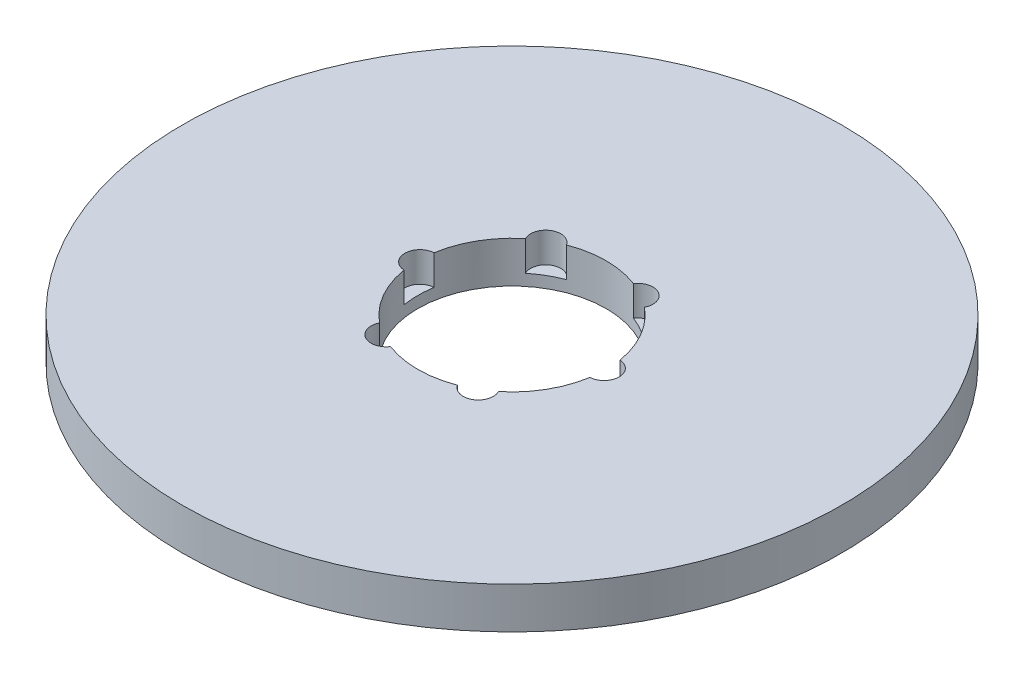
ISO-10303-21;
HEADER;
FILE_DESCRIPTION(('STEP AP214'),'2;1');
FILE_NAME('part.step','',(''),(''),'','','');
FILE_SCHEMA(('AUTOMOTIVE_DESIGN { 1 0 10303 214 1 1 1 1 }'));
ENDSEC;
DATA;
#1=APPLICATION_CONTEXT('core data for automotive mechanical design processes');
#2=APPLICATION_PROTOCOL_DEFINITION('international standard','automotive_design',2000,#1);
#3=PRODUCT_CONTEXT('',#1,'mechanical');
#4=PRODUCT('Part','Part','',(#3));
#5=PRODUCT_RELATED_PRODUCT_CATEGORY('part','',(#4));
#6=PRODUCT_DEFINITION_FORMATION('','',#4);
#7=PRODUCT_DEFINITION_CONTEXT('part definition',#1,'design');
#8=PRODUCT_DEFINITION('design','',#6,#7);
#9=PRODUCT_DEFINITION_SHAPE('','',#8);
#10=(LENGTH_UNIT() NAMED_UNIT(*) SI_UNIT(.MILLI.,.METRE.));
#11=(NAMED_UNIT(*) PLANE_ANGLE_UNIT() SI_UNIT($,.RADIAN.));
#12=(NAMED_UNIT(*) SI_UNIT($,.STERADIAN.) SOLID_ANGLE_UNIT());
#13=UNCERTAINTY_MEASURE_WITH_UNIT(LENGTH_MEASURE(1.E-05),#10,'distance_accuracy_value','');
#14=(GEOMETRIC_REPRESENTATION_CONTEXT(3) GLOBAL_UNCERTAINTY_ASSIGNED_CONTEXT((#13)) GLOBAL_UNIT_ASSIGNED_CONTEXT((#10,
#11,#12)) REPRESENTATION_CONTEXT('',''));
#15=CARTESIAN_POINT('',(0.,0.,0.));
#16=DIRECTION('',(0.,0.,1.));
#17=DIRECTION('',(1.,0.,0.));
#18=AXIS2_PLACEMENT_3D('',#15,#16,#17);
#19=CARTESIAN_POINT('',(0.,11.,0.));
#20=DIRECTION('',(0.,-1.,0.));
#21=DIRECTION('',(0.,0.,-1.));
#22=AXIS2_PLACEMENT_3D('',#19,#20,#21);
#23=CYLINDRICAL_SURFACE('',#22,87.5);
#24=CARTESIAN_POINT('',(0.,11.,0.));
#25=DIRECTION('',(0.,1.,0.));
#26=DIRECTION('',(0.,0.,1.));
#27=AXIS2_PLACEMENT_3D('',#24,#25,#26);
#28=CIRCLE('',#27,87.5);
#29=CARTESIAN_POINT('',(0.,11.,87.5));
#30=VERTEX_POINT('',#29);
#31=EDGE_CURVE('E162',#30,#30,#28,.T.);
#32=ORIENTED_EDGE('',*,*,#31,.F.);
#33=EDGE_LOOP('',(#32));
#34=FACE_BOUND('',#33,.T.);
#35=CARTESIAN_POINT('',(0.,0.,0.));
#36=DIRECTION('',(0.,1.,0.));
#37=DIRECTION('',(0.,0.,1.));
#38=AXIS2_PLACEMENT_3D('',#35,#36,#37);
#39=CIRCLE('',#38,87.5);
#40=CARTESIAN_POINT('',(0.,0.,87.5));
#41=VERTEX_POINT('',#40);
#42=EDGE_CURVE('E157',#41,#41,#39,.T.);
#43=ORIENTED_EDGE('',*,*,#42,.T.);
#44=EDGE_LOOP('',(#43));
#45=FACE_BOUND('',#44,.T.);
#46=ADVANCED_FACE('F39',(#34,#45),#23,.T.);
#47=CARTESIAN_POINT('',(0.,11.,0.));
#48=DIRECTION('',(0.,1.,0.));
#49=DIRECTION('',(0.,0.,1.));
#50=AXIS2_PLACEMENT_3D('',#47,#48,#49);
#51=PLANE('',#50);
#52=CARTESIAN_POINT('',(-12.2324873115879,11.,-21.1872895266112));
#53=DIRECTION('',(0.,1.,0.));
#54=DIRECTION('',(-0.866025403784433,0.,0.50000000000001));
#55=AXIS2_PLACEMENT_3D('',#52,#53,#54);
#56=CIRCLE('',#55,3.98952757217);
#57=CARTESIAN_POINT('',(-8.89029712949527,11.,-23.3658429539636));
#58=VERTEX_POINT('',#57);
#59=CARTESIAN_POINT('',(-15.7902650142229,11.,-19.3821446383162));
#60=VERTEX_POINT('',#59);
#61=EDGE_CURVE('E218',#58,#60,#56,.T.);
#62=ORIENTED_EDGE('',*,*,#61,.F.);
#63=CARTESIAN_POINT('',(0.,11.,0.));
#64=DIRECTION('',(0.,1.,0.));
#65=DIRECTION('',(0.,0.,1.));
#66=AXIS2_PLACEMENT_3D('',#63,#64,#65);
#67=CIRCLE('',#66,25.);
#68=CARTESIAN_POINT('',(8.89029712949478,11.,-23.3658429539637));
#69=VERTEX_POINT('',#68);
#70=EDGE_CURVE('E169',#69,#58,#67,.T.);
#71=ORIENTED_EDGE('',*,*,#70,.F.);
#72=CARTESIAN_POINT('',(12.2324873115874,11.,-21.1872895266115));
#73=DIRECTION('',(0.,1.,0.));
#74=DIRECTION('',(-0.866025403784443,0.,-0.499999999999992));
#75=AXIS2_PLACEMENT_3D('',#72,#73,#74);
#76=CIRCLE('',#75,3.98952757217);
#77=CARTESIAN_POINT('',(15.7902650142225,11.,-19.3821446383165));
#78=VERTEX_POINT('',#77);
#79=EDGE_CURVE('E285',#78,#69,#76,.T.);
#80=ORIENTED_EDGE('',*,*,#79,.F.);
#81=CARTESIAN_POINT('',(24.6805621437177,11.,-3.98369831564729));
#82=VERTEX_POINT('',#81);
#83=EDGE_CURVE('E174',#82,#78,#67,.T.);
#84=ORIENTED_EDGE('',*,*,#83,.F.);
#85=CARTESIAN_POINT('',(24.4649746231753,11.,0.));
#86=DIRECTION('',(0.,1.,0.));
#87=DIRECTION('',(0.,0.,-1.));
#88=AXIS2_PLACEMENT_3D('',#85,#86,#87);
#89=CIRCLE('',#88,3.98952757217);
#90=CARTESIAN_POINT('',(24.6805621437177,11.,3.98369831564729));
#91=VERTEX_POINT('',#90);
#92=EDGE_CURVE('E280',#91,#82,#89,.T.);
#93=ORIENTED_EDGE('',*,*,#92,.F.);
#94=CARTESIAN_POINT('',(15.7902650142227,11.,19.3821446383163));
#95=VERTEX_POINT('',#94);
#96=EDGE_CURVE('E164',#95,#91,#67,.T.);
#97=ORIENTED_EDGE('',*,*,#96,.F.);
#98=CARTESIAN_POINT('',(12.2324873115877,11.,21.1872895266113));
#99=DIRECTION('',(0.,1.,0.));
#100=DIRECTION('',(0.866025403784436,0.,-0.500000000000004));
#101=AXIS2_PLACEMENT_3D('',#98,#99,#100);
#102=CIRCLE('',#101,3.98952757217);
#103=CARTESIAN_POINT('',(8.89029712949511,11.,23.3658429539636));
#104=VERTEX_POINT('',#103);
#105=EDGE_CURVE('E269',#104,#95,#102,.T.);
#106=ORIENTED_EDGE('',*,*,#105,.F.);
#107=CARTESIAN_POINT('',(-8.89029712949495,11.,23.3658429539637));
#108=VERTEX_POINT('',#107);
#109=EDGE_CURVE('E149',#108,#104,#67,.T.);
#110=ORIENTED_EDGE('',*,*,#109,.F.);
#111=CARTESIAN_POINT('',(-12.2324873115876,11.,21.1872895266114));
#112=DIRECTION('',(0.,1.,0.));
#113=DIRECTION('',(0.86602540378444,0.,0.499999999999998));
#114=AXIS2_PLACEMENT_3D('',#111,#112,#113);
#115=CIRCLE('',#114,3.98952757217);
#116=CARTESIAN_POINT('',(-15.7902650142226,11.,19.3821446383164));
#117=VERTEX_POINT('',#116);
#118=EDGE_CURVE('E128',#117,#108,#115,.T.);
#119=ORIENTED_EDGE('',*,*,#118,.F.);
#120=CARTESIAN_POINT('',(-24.6805621437177,11.,3.98369831564729));
#121=VERTEX_POINT('',#120);
#122=EDGE_CURVE('E148',#121,#117,#67,.T.);
#123=ORIENTED_EDGE('',*,*,#122,.F.);
#124=CARTESIAN_POINT('',(-24.4649746231753,11.,0.));
#125=DIRECTION('',(0.,1.,0.));
#126=DIRECTION('',(0.,0.,1.));
#127=AXIS2_PLACEMENT_3D('',#124,#125,#126);
#128=CIRCLE('',#127,3.98952757217);
#129=CARTESIAN_POINT('',(-24.6805621437177,11.,-3.98369831564729));
#130=VERTEX_POINT('',#129);
#131=EDGE_CURVE('E179',#130,#121,#128,.T.);
#132=ORIENTED_EDGE('',*,*,#131,.F.);
#133=EDGE_CURVE('E161',#60,#130,#67,.T.);
#134=ORIENTED_EDGE('',*,*,#133,.F.);
#135=EDGE_LOOP('',(#62,#71,#80,#84,#93,#97,#106,#110,#119,#123,#132,#134));
#136=FACE_BOUND('',#135,.T.);
#137=ORIENTED_EDGE('',*,*,#31,.T.);
#138=EDGE_LOOP('',(#137));
#139=FACE_BOUND('',#138,.T.);
#140=ADVANCED_FACE('F141',(#136,#139),#51,.T.);
#141=CARTESIAN_POINT('',(0.,0.,0.));
#142=DIRECTION('',(0.,1.,0.));
#143=DIRECTION('',(0.,0.,1.));
#144=AXIS2_PLACEMENT_3D('',#141,#142,#143);
#145=PLANE('',#144);
#146=CARTESIAN_POINT('',(0.,0.,0.));
#147=DIRECTION('',(0.,1.,0.));
#148=DIRECTION('',(0.,0.,1.));
#149=AXIS2_PLACEMENT_3D('',#146,#147,#148);
#150=CIRCLE('',#149,25.);
#151=CARTESIAN_POINT('',(0.,0.,25.));
#152=VERTEX_POINT('',#151);
#153=EDGE_CURVE('E166',#152,#152,#150,.T.);
#154=ORIENTED_EDGE('',*,*,#153,.T.);
#155=EDGE_LOOP('',(#154));
#156=FACE_BOUND('',#155,.T.);
#157=ORIENTED_EDGE('',*,*,#42,.F.);
#158=EDGE_LOOP('',(#157));
#159=FACE_BOUND('',#158,.T.);
#160=ADVANCED_FACE('F234',(#156,#159),#145,.F.);
#161=CARTESIAN_POINT('',(0.,11.,0.));
#162=DIRECTION('',(0.,-1.,0.));
#163=DIRECTION('',(0.,0.,-1.));
#164=AXIS2_PLACEMENT_3D('',#161,#162,#163);
#165=CYLINDRICAL_SURFACE('',#164,25.);
#166=DIRECTION('',(0.,1.,0.));
#167=VECTOR('',#166,1.);
#168=CARTESIAN_POINT('',(-8.89029712949527,7.01535794355534,-23.3658429539636));
#169=LINE('',#168,#167);
#170=CARTESIAN_POINT('',(-8.89029712949527,3.03071588711069,-23.3658429539636));
#171=VERTEX_POINT('',#170);
#172=EDGE_CURVE('E11',#171,#58,#169,.T.);
#173=ORIENTED_EDGE('',*,*,#172,.F.);
#174=CARTESIAN_POINT('',(0.,3.03071588711069,0.));
#175=DIRECTION('',(0.,1.,0.));
#176=DIRECTION('',(0.,0.,1.));
#177=AXIS2_PLACEMENT_3D('',#174,#175,#176);
#178=CIRCLE('',#177,25.);
#179=CARTESIAN_POINT('',(-15.7902650142229,3.03071588711069,-19.3821446383162));
#180=VERTEX_POINT('',#179);
#181=EDGE_CURVE('E214',#171,#180,#178,.T.);
#182=ORIENTED_EDGE('',*,*,#181,.T.);
#183=DIRECTION('',(0.,1.,0.));
#184=VECTOR('',#183,1.);
#185=CARTESIAN_POINT('',(-15.7902650142229,7.01535794355534,-19.3821446383162));
#186=LINE('',#185,#184);
#187=EDGE_CURVE('E46',#60,#180,#186,.F.);
#188=ORIENTED_EDGE('',*,*,#187,.F.);
#189=ORIENTED_EDGE('',*,*,#133,.T.);
#190=DIRECTION('',(0.,1.,0.));
#191=VECTOR('',#190,1.);
#192=CARTESIAN_POINT('',(-24.6805621437177,7.01535794355534,-3.98369831564729));
#193=LINE('',#192,#191);
#194=CARTESIAN_POINT('',(-24.6805621437177,3.03071588711069,-3.98369831564729));
#195=VERTEX_POINT('',#194);
#196=EDGE_CURVE('E187',#195,#130,#193,.T.);
#197=ORIENTED_EDGE('',*,*,#196,.F.);
#198=CARTESIAN_POINT('',(0.,3.03071588711069,0.));
#199=DIRECTION('',(0.,1.,0.));
#200=DIRECTION('',(0.,0.,1.));
#201=AXIS2_PLACEMENT_3D('',#198,#199,#200);
#202=CIRCLE('',#201,25.);
#203=CARTESIAN_POINT('',(-24.6805621437177,3.03071588711069,3.98369831564729));
#204=VERTEX_POINT('',#203);
#205=EDGE_CURVE('E184',#195,#204,#202,.T.);
#206=ORIENTED_EDGE('',*,*,#205,.T.);
#207=DIRECTION('',(0.,1.,0.));
#208=VECTOR('',#207,1.);
#209=CARTESIAN_POINT('',(-24.6805621437177,7.01535794355534,3.98369831564729));
#210=LINE('',#209,#208);
#211=EDGE_CURVE('E158',#121,#204,#210,.F.);
#212=ORIENTED_EDGE('',*,*,#211,.F.);
#213=ORIENTED_EDGE('',*,*,#122,.T.);
#214=DIRECTION('',(0.,1.,0.));
#215=VECTOR('',#214,1.);
#216=CARTESIAN_POINT('',(-15.7902650142226,7.01535794355534,19.3821446383164));
#217=LINE('',#216,#215);
#218=CARTESIAN_POINT('',(-15.7902650142226,3.03071588711069,19.3821446383164));
#219=VERTEX_POINT('',#218);
#220=EDGE_CURVE('E127',#219,#117,#217,.T.);
#221=ORIENTED_EDGE('',*,*,#220,.F.);
#222=CARTESIAN_POINT('',(0.,3.03071588711069,0.));
#223=DIRECTION('',(0.,1.,0.));
#224=DIRECTION('',(0.,0.,1.));
#225=AXIS2_PLACEMENT_3D('',#222,#223,#224);
#226=CIRCLE('',#225,25.);
#227=CARTESIAN_POINT('',(-8.89029712949495,3.03071588711069,23.3658429539637));
#228=VERTEX_POINT('',#227);
#229=EDGE_CURVE('E189',#219,#228,#226,.T.);
#230=ORIENTED_EDGE('',*,*,#229,.T.);
#231=DIRECTION('',(0.,1.,0.));
#232=VECTOR('',#231,1.);
#233=CARTESIAN_POINT('',(-8.89029712949495,7.01535794355534,23.3658429539637));
#234=LINE('',#233,#232);
#235=EDGE_CURVE('E140',#108,#228,#234,.F.);
#236=ORIENTED_EDGE('',*,*,#235,.F.);
#237=ORIENTED_EDGE('',*,*,#109,.T.);
#238=DIRECTION('',(0.,1.,0.));
#239=VECTOR('',#238,1.);
#240=CARTESIAN_POINT('',(8.89029712949511,7.01535794355534,23.3658429539636));
#241=LINE('',#240,#239);
#242=CARTESIAN_POINT('',(8.89029712949511,3.03071588711069,23.3658429539636));
#243=VERTEX_POINT('',#242);
#244=EDGE_CURVE('E196',#243,#104,#241,.T.);
#245=ORIENTED_EDGE('',*,*,#244,.F.);
#246=CARTESIAN_POINT('',(0.,3.03071588711069,0.));
#247=DIRECTION('',(0.,1.,0.));
#248=DIRECTION('',(0.,0.,1.));
#249=AXIS2_PLACEMENT_3D('',#246,#247,#248);
#250=CIRCLE('',#249,25.);
#251=CARTESIAN_POINT('',(15.7902650142227,3.03071588711069,19.3821446383163));
#252=VERTEX_POINT('',#251);
#253=EDGE_CURVE('E136',#243,#252,#250,.T.);
#254=ORIENTED_EDGE('',*,*,#253,.T.);
#255=DIRECTION('',(0.,1.,0.));
#256=VECTOR('',#255,1.);
#257=CARTESIAN_POINT('',(15.7902650142227,7.01535794355534,19.3821446383163));
#258=LINE('',#257,#256);
#259=EDGE_CURVE('E194',#95,#252,#258,.F.);
#260=ORIENTED_EDGE('',*,*,#259,.F.);
#261=ORIENTED_EDGE('',*,*,#96,.T.);
#262=DIRECTION('',(0.,1.,0.));
#263=VECTOR('',#262,1.);
#264=CARTESIAN_POINT('',(24.6805621437177,7.01535794355534,3.98369831564729));
#265=LINE('',#264,#263);
#266=CARTESIAN_POINT('',(24.6805621437177,3.03071588711069,3.98369831564729));
#267=VERTEX_POINT('',#266);
#268=EDGE_CURVE('E206',#267,#91,#265,.T.);
#269=ORIENTED_EDGE('',*,*,#268,.F.);
#270=CARTESIAN_POINT('',(0.,3.03071588711069,0.));
#271=DIRECTION('',(0.,1.,0.));
#272=DIRECTION('',(0.,0.,1.));
#273=AXIS2_PLACEMENT_3D('',#270,#271,#272);
#274=CIRCLE('',#273,25.);
#275=CARTESIAN_POINT('',(24.6805621437177,3.03071588711069,-3.98369831564729));
#276=VERTEX_POINT('',#275);
#277=EDGE_CURVE('E199',#267,#276,#274,.T.);
#278=ORIENTED_EDGE('',*,*,#277,.T.);
#279=DIRECTION('',(0.,1.,0.));
#280=VECTOR('',#279,1.);
#281=CARTESIAN_POINT('',(24.6805621437177,7.01535794355534,-3.98369831564729));
#282=LINE('',#281,#280);
#283=EDGE_CURVE('E201',#82,#276,#282,.F.);
#284=ORIENTED_EDGE('',*,*,#283,.F.);
#285=ORIENTED_EDGE('',*,*,#83,.T.);
#286=DIRECTION('',(0.,1.,0.));
#287=VECTOR('',#286,1.);
#288=CARTESIAN_POINT('',(15.7902650142225,7.01535794355534,-19.3821446383165));
#289=LINE('',#288,#287);
#290=CARTESIAN_POINT('',(15.7902650142225,3.03071588711069,-19.3821446383165));
#291=VERTEX_POINT('',#290);
#292=EDGE_CURVE('E213',#291,#78,#289,.T.);
#293=ORIENTED_EDGE('',*,*,#292,.F.);
#294=CARTESIAN_POINT('',(0.,3.03071588711069,0.));
#295=DIRECTION('',(0.,1.,0.));
#296=DIRECTION('',(0.,0.,1.));
#297=AXIS2_PLACEMENT_3D('',#294,#295,#296);
#298=CIRCLE('',#297,25.);
#299=CARTESIAN_POINT('',(8.89029712949478,3.03071588711069,-23.3658429539637));
#300=VERTEX_POINT('',#299);
#301=EDGE_CURVE('E208',#291,#300,#298,.T.);
#302=ORIENTED_EDGE('',*,*,#301,.T.);
#303=DIRECTION('',(0.,1.,0.));
#304=VECTOR('',#303,1.);
#305=CARTESIAN_POINT('',(8.89029712949478,7.01535794355534,-23.3658429539637));
#306=LINE('',#305,#304);
#307=EDGE_CURVE('E211',#69,#300,#306,.F.);
#308=ORIENTED_EDGE('',*,*,#307,.F.);
#309=ORIENTED_EDGE('',*,*,#70,.T.);
#310=EDGE_LOOP('',(#173,#182,#188,#189,#197,#206,#212,#213,#221,#230,#236,#237,#245,#254,#260,
#261,#269,#278,#284,#285,#293,#302,#308,#309));
#311=FACE_BOUND('',#310,.T.);
#312=ORIENTED_EDGE('',*,*,#153,.F.);
#313=EDGE_LOOP('',(#312));
#314=FACE_BOUND('',#313,.T.);
#315=ADVANCED_FACE('F152',(#311,#314),#165,.F.);
#316=CARTESIAN_POINT('',(-24.4649746231753,3.03071588711069,0.));
#317=DIRECTION('',(0.,1.,0.));
#318=DIRECTION('',(0.,0.,1.));
#319=AXIS2_PLACEMENT_3D('',#316,#317,#318);
#320=CYLINDRICAL_SURFACE('',#319,3.98952757217);
#321=ORIENTED_EDGE('',*,*,#196,.T.);
#322=ORIENTED_EDGE('',*,*,#131,.T.);
#323=ORIENTED_EDGE('',*,*,#211,.T.);
#324=CARTESIAN_POINT('',(-24.4649746231753,3.03071588711069,0.));
#325=DIRECTION('',(0.,1.,0.));
#326=DIRECTION('',(0.,0.,1.));
#327=AXIS2_PLACEMENT_3D('',#324,#325,#326);
#328=CIRCLE('',#327,3.98952757217);
#329=EDGE_CURVE('E180',#195,#204,#328,.T.);
#330=ORIENTED_EDGE('',*,*,#329,.F.);
#331=EDGE_LOOP('',(#321,#322,#323,#330));
#332=FACE_BOUND('',#331,.T.);
#333=ADVANCED_FACE('F244',(#332),#320,.F.);
#334=CARTESIAN_POINT('',(-24.4649746231753,3.03071588711069,0.));
#335=DIRECTION('',(0.,1.,0.));
#336=DIRECTION('',(0.,0.,1.));
#337=AXIS2_PLACEMENT_3D('',#334,#335,#336);
#338=PLANE('',#337);
#339=ORIENTED_EDGE('',*,*,#329,.T.);
#340=ORIENTED_EDGE('',*,*,#205,.F.);
#341=EDGE_LOOP('',(#339,#340));
#342=FACE_BOUND('',#341,.T.);
#343=ADVANCED_FACE('F248',(#342),#338,.T.);
#344=CARTESIAN_POINT('',(-12.2324873115876,3.03071588711069,21.1872895266114));
#345=DIRECTION('',(0.,1.,0.));
#346=DIRECTION('',(0.,0.,1.));
#347=AXIS2_PLACEMENT_3D('',#344,#345,#346);
#348=CYLINDRICAL_SURFACE('',#347,3.98952757217);
#349=ORIENTED_EDGE('',*,*,#220,.T.);
#350=ORIENTED_EDGE('',*,*,#118,.T.);
#351=ORIENTED_EDGE('',*,*,#235,.T.);
#352=CARTESIAN_POINT('',(-12.2324873115876,3.03071588711069,21.1872895266114));
#353=DIRECTION('',(0.,1.,0.));
#354=DIRECTION('',(0.86602540378444,0.,0.499999999999998));
#355=AXIS2_PLACEMENT_3D('',#352,#353,#354);
#356=CIRCLE('',#355,3.98952757217);
#357=EDGE_CURVE('E135',#219,#228,#356,.T.);
#358=ORIENTED_EDGE('',*,*,#357,.F.);
#359=EDGE_LOOP('',(#349,#350,#351,#358));
#360=FACE_BOUND('',#359,.T.);
#361=ADVANCED_FACE('F126',(#360),#348,.F.);
#362=CARTESIAN_POINT('',(-12.2324873115876,3.03071588711069,21.1872895266114));
#363=DIRECTION('',(0.,1.,0.));
#364=DIRECTION('',(0.86602540378444,0.,0.499999999999998));
#365=AXIS2_PLACEMENT_3D('',#362,#363,#364);
#366=PLANE('',#365);
#367=ORIENTED_EDGE('',*,*,#357,.T.);
#368=ORIENTED_EDGE('',*,*,#229,.F.);
#369=EDGE_LOOP('',(#367,#368));
#370=FACE_BOUND('',#369,.T.);
#371=ADVANCED_FACE('F258',(#370),#366,.T.);
#372=CARTESIAN_POINT('',(12.2324873115877,3.03071588711069,21.1872895266113));
#373=DIRECTION('',(0.,1.,0.));
#374=DIRECTION('',(0.,0.,1.));
#375=AXIS2_PLACEMENT_3D('',#372,#373,#374);
#376=CYLINDRICAL_SURFACE('',#375,3.98952757217);
#377=ORIENTED_EDGE('',*,*,#244,.T.);
#378=ORIENTED_EDGE('',*,*,#105,.T.);
#379=ORIENTED_EDGE('',*,*,#259,.T.);
#380=CARTESIAN_POINT('',(12.2324873115877,3.03071588711069,21.1872895266113));
#381=DIRECTION('',(0.,1.,0.));
#382=DIRECTION('',(0.866025403784436,0.,-0.500000000000004));
#383=AXIS2_PLACEMENT_3D('',#380,#381,#382);
#384=CIRCLE('',#383,3.98952757217);
#385=EDGE_CURVE('E147',#243,#252,#384,.T.);
#386=ORIENTED_EDGE('',*,*,#385,.F.);
#387=EDGE_LOOP('',(#377,#378,#379,#386));
#388=FACE_BOUND('',#387,.T.);
#389=ADVANCED_FACE('F256',(#388),#376,.F.);
#390=CARTESIAN_POINT('',(12.2324873115877,3.03071588711069,21.1872895266113));
#391=DIRECTION('',(0.,1.,0.));
#392=DIRECTION('',(0.866025403784436,0.,-0.500000000000004));
#393=AXIS2_PLACEMENT_3D('',#390,#391,#392);
#394=PLANE('',#393);
#395=ORIENTED_EDGE('',*,*,#385,.T.);
#396=ORIENTED_EDGE('',*,*,#253,.F.);
#397=EDGE_LOOP('',(#395,#396));
#398=FACE_BOUND('',#397,.T.);
#399=ADVANCED_FACE('F263',(#398),#394,.T.);
#400=CARTESIAN_POINT('',(24.4649746231753,3.03071588711069,0.));
#401=DIRECTION('',(0.,1.,0.));
#402=DIRECTION('',(0.,0.,1.));
#403=AXIS2_PLACEMENT_3D('',#400,#401,#402);
#404=CYLINDRICAL_SURFACE('',#403,3.98952757217);
#405=ORIENTED_EDGE('',*,*,#268,.T.);
#406=ORIENTED_EDGE('',*,*,#92,.T.);
#407=ORIENTED_EDGE('',*,*,#283,.T.);
#408=CARTESIAN_POINT('',(24.4649746231753,3.03071588711069,0.));
#409=DIRECTION('',(0.,1.,0.));
#410=DIRECTION('',(0.,0.,-1.));
#411=AXIS2_PLACEMENT_3D('',#408,#409,#410);
#412=CIRCLE('',#411,3.98952757217);
#413=EDGE_CURVE('E273',#267,#276,#412,.T.);
#414=ORIENTED_EDGE('',*,*,#413,.F.);
#415=EDGE_LOOP('',(#405,#406,#407,#414));
#416=FACE_BOUND('',#415,.T.);
#417=ADVANCED_FACE('F297',(#416),#404,.F.);
#418=CARTESIAN_POINT('',(24.4649746231753,3.03071588711069,0.));
#419=DIRECTION('',(0.,1.,0.));
#420=DIRECTION('',(0.,0.,-1.));
#421=AXIS2_PLACEMENT_3D('',#418,#419,#420);
#422=PLANE('',#421);
#423=ORIENTED_EDGE('',*,*,#413,.T.);
#424=ORIENTED_EDGE('',*,*,#277,.F.);
#425=EDGE_LOOP('',(#423,#424));
#426=FACE_BOUND('',#425,.T.);
#427=ADVANCED_FACE('F299',(#426),#422,.T.);
#428=CARTESIAN_POINT('',(12.2324873115874,3.03071588711069,-21.1872895266115));
#429=DIRECTION('',(0.,1.,0.));
#430=DIRECTION('',(0.,0.,1.));
#431=AXIS2_PLACEMENT_3D('',#428,#429,#430);
#432=CYLINDRICAL_SURFACE('',#431,3.98952757217);
#433=ORIENTED_EDGE('',*,*,#292,.T.);
#434=ORIENTED_EDGE('',*,*,#79,.T.);
#435=ORIENTED_EDGE('',*,*,#307,.T.);
#436=CARTESIAN_POINT('',(12.2324873115874,3.03071588711069,-21.1872895266115));
#437=DIRECTION('',(0.,1.,0.));
#438=DIRECTION('',(-0.866025403784443,0.,-0.499999999999992));
#439=AXIS2_PLACEMENT_3D('',#436,#437,#438);
#440=CIRCLE('',#439,3.98952757217);
#441=EDGE_CURVE('E56',#291,#300,#440,.T.);
#442=ORIENTED_EDGE('',*,*,#441,.F.);
#443=EDGE_LOOP('',(#433,#434,#435,#442));
#444=FACE_BOUND('',#443,.T.);
#445=ADVANCED_FACE('F292',(#444),#432,.F.);
#446=CARTESIAN_POINT('',(12.2324873115874,3.03071588711069,-21.1872895266115));
#447=DIRECTION('',(0.,1.,0.));
#448=DIRECTION('',(-0.866025403784443,0.,-0.499999999999992));
#449=AXIS2_PLACEMENT_3D('',#446,#447,#448);
#450=PLANE('',#449);
#451=ORIENTED_EDGE('',*,*,#441,.T.);
#452=ORIENTED_EDGE('',*,*,#301,.F.);
#453=EDGE_LOOP('',(#451,#452));
#454=FACE_BOUND('',#453,.T.);
#455=ADVANCED_FACE('F226',(#454),#450,.T.);
#456=CARTESIAN_POINT('',(-12.2324873115879,3.03071588711069,-21.1872895266112));
#457=DIRECTION('',(0.,1.,0.));
#458=DIRECTION('',(0.,0.,1.));
#459=AXIS2_PLACEMENT_3D('',#456,#457,#458);
#460=CYLINDRICAL_SURFACE('',#459,3.98952757217);
#461=ORIENTED_EDGE('',*,*,#172,.T.);
#462=ORIENTED_EDGE('',*,*,#61,.T.);
#463=ORIENTED_EDGE('',*,*,#187,.T.);
#464=CARTESIAN_POINT('',(-12.2324873115879,3.03071588711069,-21.1872895266112));
#465=DIRECTION('',(0.,1.,0.));
#466=DIRECTION('',(-0.866025403784433,0.,0.50000000000001));
#467=AXIS2_PLACEMENT_3D('',#464,#465,#466);
#468=CIRCLE('',#467,3.98952757217);
#469=EDGE_CURVE('E55',#171,#180,#468,.T.);
#470=ORIENTED_EDGE('',*,*,#469,.F.);
#471=EDGE_LOOP('',(#461,#462,#463,#470));
#472=FACE_BOUND('',#471,.T.);
#473=ADVANCED_FACE('F217',(#472),#460,.F.);
#474=CARTESIAN_POINT('',(-12.2324873115879,3.03071588711069,-21.1872895266112));
#475=DIRECTION('',(0.,1.,0.));
#476=DIRECTION('',(-0.866025403784433,0.,0.50000000000001));
#477=AXIS2_PLACEMENT_3D('',#474,#475,#476);
#478=PLANE('',#477);
#479=ORIENTED_EDGE('',*,*,#469,.T.);
#480=ORIENTED_EDGE('',*,*,#181,.F.);
#481=EDGE_LOOP('',(#479,#480));
#482=FACE_BOUND('',#481,.T.);
#483=ADVANCED_FACE('F219',(#482),#478,.T.);
#484=CLOSED_SHELL('',(#46,#140,#160,#315,#333,#343,#361,#371,#389,#399,#417,#427,#445,#455,#473,#483));
#485=MANIFOLD_SOLID_BREP('B2',#484);
#486=ADVANCED_BREP_SHAPE_REPRESENTATION('',(#18,#485),#14);
#487=SHAPE_DEFINITION_REPRESENTATION(#9,#486);
ENDSEC;
END-ISO-10303-21;
